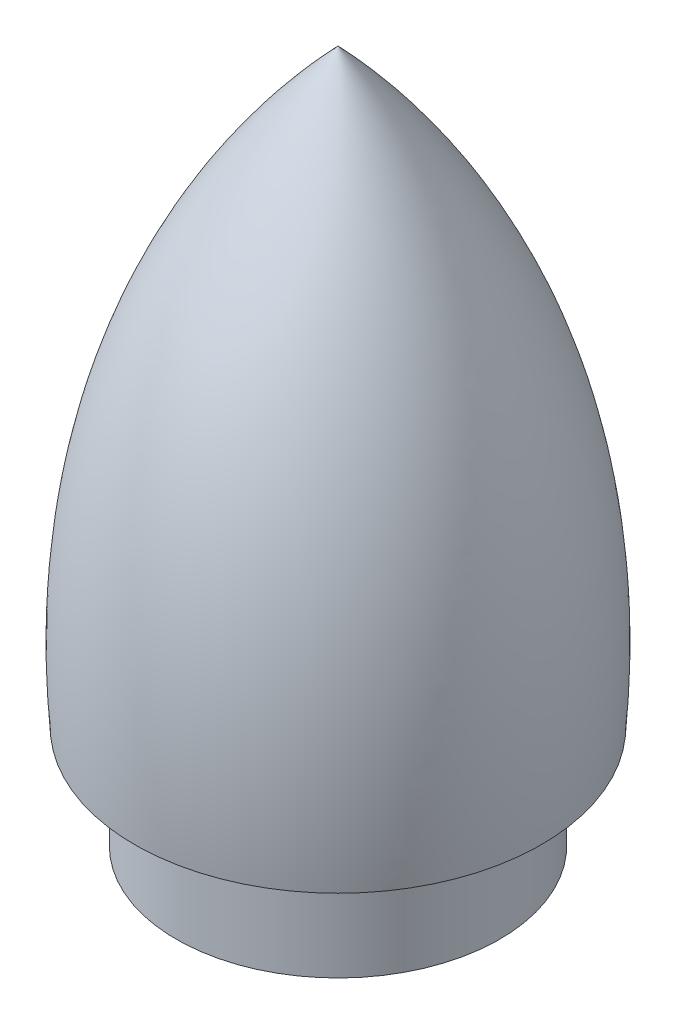
ISO-10303-21;
HEADER;
FILE_DESCRIPTION(('STEP AP214'),'2;1');
FILE_NAME('part.step','',(''),(''),'','','');
FILE_SCHEMA(('AUTOMOTIVE_DESIGN { 1 0 10303 214 1 1 1 1 }'));
ENDSEC;
DATA;
#1=APPLICATION_CONTEXT('core data for automotive mechanical design processes');
#2=APPLICATION_PROTOCOL_DEFINITION('international standard','automotive_design',2000,#1);
#3=PRODUCT_CONTEXT('',#1,'mechanical');
#4=PRODUCT('Part','Part','',(#3));
#5=PRODUCT_RELATED_PRODUCT_CATEGORY('part','',(#4));
#6=PRODUCT_DEFINITION_FORMATION('','',#4);
#7=PRODUCT_DEFINITION_CONTEXT('part definition',#1,'design');
#8=PRODUCT_DEFINITION('design','',#6,#7);
#9=PRODUCT_DEFINITION_SHAPE('','',#8);
#10=(LENGTH_UNIT() NAMED_UNIT(*) SI_UNIT(.MILLI.,.METRE.));
#11=(NAMED_UNIT(*) PLANE_ANGLE_UNIT() SI_UNIT($,.RADIAN.));
#12=(NAMED_UNIT(*) SI_UNIT($,.STERADIAN.) SOLID_ANGLE_UNIT());
#13=UNCERTAINTY_MEASURE_WITH_UNIT(LENGTH_MEASURE(1.E-05),#10,'distance_accuracy_value','');
#14=(GEOMETRIC_REPRESENTATION_CONTEXT(3) GLOBAL_UNCERTAINTY_ASSIGNED_CONTEXT((#13)) GLOBAL_UNIT_ASSIGNED_CONTEXT((#10,
#11,#12)) REPRESENTATION_CONTEXT('',''));
#15=CARTESIAN_POINT('',(0.,0.,0.));
#16=DIRECTION('',(0.,0.,1.));
#17=DIRECTION('',(1.,0.,0.));
#18=AXIS2_PLACEMENT_3D('',#15,#16,#17);
#19=CARTESIAN_POINT('',(0.,87.0400825923102,0.));
#20=CARTESIAN_POINT('',(-17.1565365886175,69.1520771579915,0.));
#21=CARTESIAN_POINT('',(-15.1008035113069,43.2661928778835,0.));
#22=B_SPLINE_CURVE_WITH_KNOTS('',2,(#19,#20,#21),.UNSPECIFIED.,.F.,.F.,(3,3),(0.,1.),.UNSPECIFIED.);
#23=CARTESIAN_POINT('',(0.,35.6281721159854,0.));
#24=DIRECTION('',(0.,-1.,0.));
#25=AXIS1_PLACEMENT('',#23,#24);
#26=SURFACE_OF_REVOLUTION('',#22,#25);
#27=CARTESIAN_POINT('',(0.,43.2661928778835,0.));
#28=DIRECTION('',(0.,-1.,0.));
#29=DIRECTION('',(0.,0.,-1.));
#30=AXIS2_PLACEMENT_3D('',#27,#28,#29);
#31=CIRCLE('',#30,15.1008035113069);
#32=CARTESIAN_POINT('',(0.,43.2661928778835,-15.1008035113069));
#33=VERTEX_POINT('',#32);
#34=EDGE_CURVE('E60',#33,#33,#31,.T.);
#35=ORIENTED_EDGE('',*,*,#34,.F.);
#36=EDGE_LOOP('',(#35));
#37=FACE_BOUND('',#36,.T.);
#38=CARTESIAN_POINT('',(0.,87.0400825923102,0.));
#39=VERTEX_POINT('',#38);
#40=VERTEX_LOOP('',#39);
#41=FACE_BOUND('',#40,.T.);
#42=ADVANCED_FACE('F40',(#37,#41),#26,.T.);
#43=CARTESIAN_POINT('',(-12.,35.6281721159854,0.));
#44=DIRECTION('',(0.,1.,0.));
#45=DIRECTION('',(0.,0.,1.));
#46=AXIS2_PLACEMENT_3D('',#43,#44,#45);
#47=PLANE('',#46);
#48=CARTESIAN_POINT('',(0.,35.6281721159854,0.));
#49=DIRECTION('',(0.,-1.,0.));
#50=DIRECTION('',(0.,0.,-1.));
#51=AXIS2_PLACEMENT_3D('',#48,#49,#50);
#52=CIRCLE('',#51,12.);
#53=CARTESIAN_POINT('',(0.,35.6281721159854,-12.));
#54=VERTEX_POINT('',#53);
#55=EDGE_CURVE('E12',#54,#54,#52,.T.);
#56=ORIENTED_EDGE('',*,*,#55,.T.);
#57=EDGE_LOOP('',(#56));
#58=FACE_BOUND('',#57,.T.);
#59=ADVANCED_FACE('F51',(#58),#47,.F.);
#60=CARTESIAN_POINT('',(0.,35.6281721159854,0.));
#61=DIRECTION('',(0.,-1.,0.));
#62=DIRECTION('',(0.,0.,-1.));
#63=AXIS2_PLACEMENT_3D('',#60,#61,#62);
#64=CYLINDRICAL_SURFACE('',#63,12.);
#65=ORIENTED_EDGE('',*,*,#55,.F.);
#66=EDGE_LOOP('',(#65));
#67=FACE_BOUND('',#66,.T.);
#68=CARTESIAN_POINT('',(0.,43.3183181880451,0.));
#69=DIRECTION('',(0.,-1.,0.));
#70=DIRECTION('',(0.,0.,-1.));
#71=AXIS2_PLACEMENT_3D('',#68,#69,#70);
#72=CIRCLE('',#71,12.);
#73=CARTESIAN_POINT('',(0.,43.3183181880451,-12.));
#74=VERTEX_POINT('',#73);
#75=EDGE_CURVE('E47',#74,#74,#72,.T.);
#76=ORIENTED_EDGE('',*,*,#75,.T.);
#77=EDGE_LOOP('',(#76));
#78=FACE_BOUND('',#77,.T.);
#79=ADVANCED_FACE('F56',(#67,#78),#64,.T.);
#80=CARTESIAN_POINT('',(0.,43.2661928778835,0.));
#81=DIRECTION('',(0.,-1.,0.));
#82=DIRECTION('',(0.,0.,-1.));
#83=AXIS2_PLACEMENT_3D('',#80,#81,#82);
#84=CONICAL_SURFACE('',#83,15.1008035113069,1.55398765095858);
#85=ORIENTED_EDGE('',*,*,#75,.F.);
#86=EDGE_LOOP('',(#85));
#87=FACE_BOUND('',#86,.T.);
#88=ORIENTED_EDGE('',*,*,#34,.T.);
#89=EDGE_LOOP('',(#88));
#90=FACE_BOUND('',#89,.T.);
#91=ADVANCED_FACE('F73',(#87,#90),#84,.F.);
#92=CLOSED_SHELL('',(#42,#59,#79,#91));
#93=MANIFOLD_SOLID_BREP('B2',#92);
#94=ADVANCED_BREP_SHAPE_REPRESENTATION('',(#18,#93),#14);
#95=SHAPE_DEFINITION_REPRESENTATION(#9,#94);
ENDSEC;
END-ISO-10303-21;
